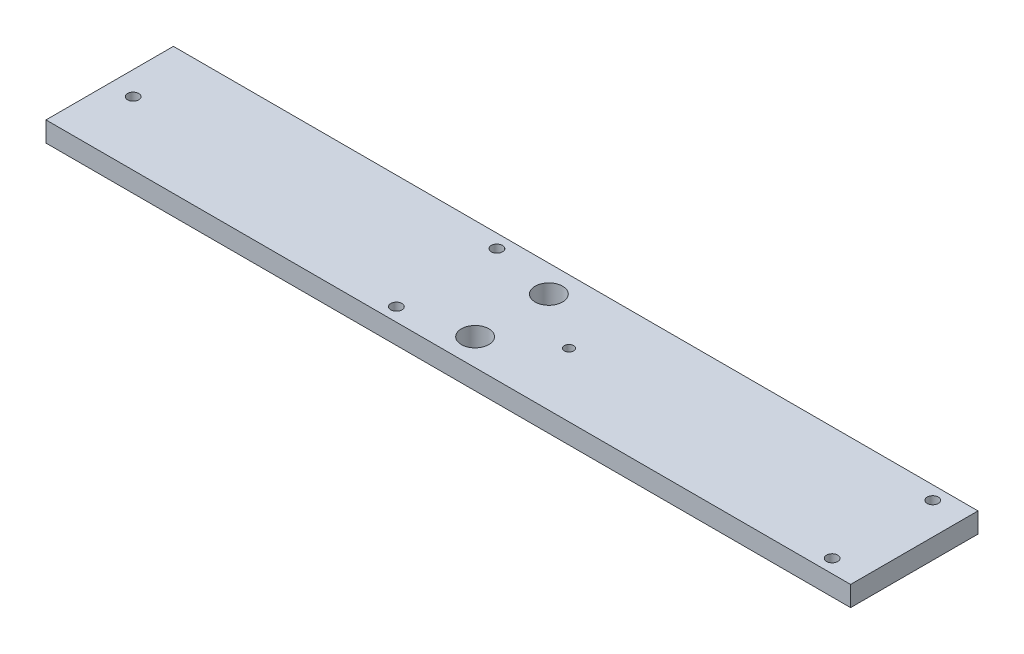
ISO-10303-21;
HEADER;
FILE_DESCRIPTION(('STEP AP214'),'2;1');
FILE_NAME('part.step','',(''),(''),'','','');
FILE_SCHEMA(('AUTOMOTIVE_DESIGN { 1 0 10303 214 1 1 1 1 }'));
ENDSEC;
DATA;
#1=APPLICATION_CONTEXT('core data for automotive mechanical design processes');
#2=APPLICATION_PROTOCOL_DEFINITION('international standard','automotive_design',2000,#1);
#3=PRODUCT_CONTEXT('',#1,'mechanical');
#4=PRODUCT('Part','Part','',(#3));
#5=PRODUCT_RELATED_PRODUCT_CATEGORY('part','',(#4));
#6=PRODUCT_DEFINITION_FORMATION('','',#4);
#7=PRODUCT_DEFINITION_CONTEXT('part definition',#1,'design');
#8=PRODUCT_DEFINITION('design','',#6,#7);
#9=PRODUCT_DEFINITION_SHAPE('','',#8);
#10=(LENGTH_UNIT() NAMED_UNIT(*) SI_UNIT(.MILLI.,.METRE.));
#11=(NAMED_UNIT(*) PLANE_ANGLE_UNIT() SI_UNIT($,.RADIAN.));
#12=(NAMED_UNIT(*) SI_UNIT($,.STERADIAN.) SOLID_ANGLE_UNIT());
#13=UNCERTAINTY_MEASURE_WITH_UNIT(LENGTH_MEASURE(1.E-05),#10,'distance_accuracy_value','');
#14=(GEOMETRIC_REPRESENTATION_CONTEXT(3) GLOBAL_UNCERTAINTY_ASSIGNED_CONTEXT((#13)) GLOBAL_UNIT_ASSIGNED_CONTEXT((#10,
#11,#12)) REPRESENTATION_CONTEXT('',''));
#15=CARTESIAN_POINT('',(0.,0.,0.));
#16=DIRECTION('',(0.,0.,1.));
#17=DIRECTION('',(1.,0.,0.));
#18=AXIS2_PLACEMENT_3D('',#15,#16,#17);
#19=CARTESIAN_POINT('',(0.,3.,0.));
#20=DIRECTION('',(1.,0.,0.));
#21=DIRECTION('',(0.,0.,-1.));
#22=AXIS2_PLACEMENT_3D('',#19,#20,#21);
#23=PLANE('',#22);
#24=DIRECTION('',(0.,0.,1.));
#25=VECTOR('',#24,1.);
#26=CARTESIAN_POINT('',(0.,0.,0.));
#27=LINE('',#26,#25);
#28=CARTESIAN_POINT('',(0.,0.,-19.));
#29=VERTEX_POINT('',#28);
#30=CARTESIAN_POINT('',(0.,0.,0.));
#31=VERTEX_POINT('',#30);
#32=EDGE_CURVE('E102',#29,#31,#27,.T.);
#33=ORIENTED_EDGE('',*,*,#32,.T.);
#34=DIRECTION('',(0.,-1.,0.));
#35=VECTOR('',#34,1.);
#36=CARTESIAN_POINT('',(0.,3.,0.));
#37=LINE('',#36,#35);
#38=CARTESIAN_POINT('',(0.,3.,0.));
#39=VERTEX_POINT('',#38);
#40=EDGE_CURVE('E11',#39,#31,#37,.T.);
#41=ORIENTED_EDGE('',*,*,#40,.F.);
#42=DIRECTION('',(0.,0.,1.));
#43=VECTOR('',#42,1.);
#44=CARTESIAN_POINT('',(0.,3.,0.));
#45=LINE('',#44,#43);
#46=CARTESIAN_POINT('',(0.,3.,-19.));
#47=VERTEX_POINT('',#46);
#48=EDGE_CURVE('E90',#47,#39,#45,.T.);
#49=ORIENTED_EDGE('',*,*,#48,.F.);
#50=DIRECTION('',(0.,-1.,0.));
#51=VECTOR('',#50,1.);
#52=CARTESIAN_POINT('',(0.,3.,-19.));
#53=LINE('',#52,#51);
#54=EDGE_CURVE('E98',#47,#29,#53,.T.);
#55=ORIENTED_EDGE('',*,*,#54,.T.);
#56=EDGE_LOOP('',(#33,#41,#49,#55));
#57=FACE_BOUND('',#56,.T.);
#58=ADVANCED_FACE('F39',(#57),#23,.F.);
#59=CARTESIAN_POINT('',(0.,3.,0.));
#60=DIRECTION('',(0.,0.,-1.));
#61=DIRECTION('',(-1.,0.,0.));
#62=AXIS2_PLACEMENT_3D('',#59,#60,#61);
#63=PLANE('',#62);
#64=DIRECTION('',(1.,0.,0.));
#65=VECTOR('',#64,1.);
#66=CARTESIAN_POINT('',(0.,0.,0.));
#67=LINE('',#66,#65);
#68=CARTESIAN_POINT('',(120.,0.,0.));
#69=VERTEX_POINT('',#68);
#70=EDGE_CURVE('E94',#31,#69,#67,.T.);
#71=ORIENTED_EDGE('',*,*,#70,.T.);
#72=DIRECTION('',(0.,-1.,0.));
#73=VECTOR('',#72,1.);
#74=CARTESIAN_POINT('',(120.,3.,0.));
#75=LINE('',#74,#73);
#76=CARTESIAN_POINT('',(120.,3.,0.));
#77=VERTEX_POINT('',#76);
#78=EDGE_CURVE('E47',#77,#69,#75,.T.);
#79=ORIENTED_EDGE('',*,*,#78,.F.);
#80=DIRECTION('',(1.,0.,0.));
#81=VECTOR('',#80,1.);
#82=CARTESIAN_POINT('',(0.,3.,0.));
#83=LINE('',#82,#81);
#84=EDGE_CURVE('E85',#39,#77,#83,.T.);
#85=ORIENTED_EDGE('',*,*,#84,.F.);
#86=ORIENTED_EDGE('',*,*,#40,.T.);
#87=EDGE_LOOP('',(#71,#79,#85,#86));
#88=FACE_BOUND('',#87,.T.);
#89=ADVANCED_FACE('F93',(#88),#63,.F.);
#90=CARTESIAN_POINT('',(120.,3.,0.));
#91=DIRECTION('',(-1.,0.,0.));
#92=DIRECTION('',(0.,0.,1.));
#93=AXIS2_PLACEMENT_3D('',#90,#91,#92);
#94=PLANE('',#93);
#95=DIRECTION('',(0.,0.,-1.));
#96=VECTOR('',#95,1.);
#97=CARTESIAN_POINT('',(120.,0.,0.));
#98=LINE('',#97,#96);
#99=CARTESIAN_POINT('',(120.,0.,-19.));
#100=VERTEX_POINT('',#99);
#101=EDGE_CURVE('E72',#69,#100,#98,.T.);
#102=ORIENTED_EDGE('',*,*,#101,.T.);
#103=DIRECTION('',(0.,-1.,0.));
#104=VECTOR('',#103,1.);
#105=CARTESIAN_POINT('',(120.,3.,-19.));
#106=LINE('',#105,#104);
#107=CARTESIAN_POINT('',(120.,3.,-19.));
#108=VERTEX_POINT('',#107);
#109=EDGE_CURVE('E95',#108,#100,#106,.T.);
#110=ORIENTED_EDGE('',*,*,#109,.F.);
#111=DIRECTION('',(0.,0.,-1.));
#112=VECTOR('',#111,1.);
#113=CARTESIAN_POINT('',(120.,3.,0.));
#114=LINE('',#113,#112);
#115=EDGE_CURVE('E88',#77,#108,#114,.T.);
#116=ORIENTED_EDGE('',*,*,#115,.F.);
#117=ORIENTED_EDGE('',*,*,#78,.T.);
#118=EDGE_LOOP('',(#102,#110,#116,#117));
#119=FACE_BOUND('',#118,.T.);
#120=ADVANCED_FACE('F96',(#119),#94,.F.);
#121=CARTESIAN_POINT('',(0.,3.,-19.));
#122=DIRECTION('',(0.,0.,1.));
#123=DIRECTION('',(1.,0.,0.));
#124=AXIS2_PLACEMENT_3D('',#121,#122,#123);
#125=PLANE('',#124);
#126=DIRECTION('',(-1.,0.,0.));
#127=VECTOR('',#126,1.);
#128=CARTESIAN_POINT('',(0.,0.,-19.));
#129=LINE('',#128,#127);
#130=EDGE_CURVE('E78',#100,#29,#129,.T.);
#131=ORIENTED_EDGE('',*,*,#130,.T.);
#132=ORIENTED_EDGE('',*,*,#54,.F.);
#133=DIRECTION('',(-1.,0.,0.));
#134=VECTOR('',#133,1.);
#135=CARTESIAN_POINT('',(0.,3.,-19.));
#136=LINE('',#135,#134);
#137=EDGE_CURVE('E55',#108,#47,#136,.T.);
#138=ORIENTED_EDGE('',*,*,#137,.F.);
#139=ORIENTED_EDGE('',*,*,#109,.T.);
#140=EDGE_LOOP('',(#131,#132,#138,#139));
#141=FACE_BOUND('',#140,.T.);
#142=ADVANCED_FACE('F110',(#141),#125,.F.);
#143=CARTESIAN_POINT('',(0.,3.,0.));
#144=DIRECTION('',(0.,-1.,0.));
#145=DIRECTION('',(0.,0.,-1.));
#146=AXIS2_PLACEMENT_3D('',#143,#144,#145);
#147=PLANE('',#146);
#148=CARTESIAN_POINT('',(3.5,3.,-9.5));
#149=DIRECTION('',(0.,1.,0.));
#150=DIRECTION('',(0.,0.,1.));
#151=AXIS2_PLACEMENT_3D('',#148,#149,#150);
#152=CIRCLE('',#151,0.834999999999999);
#153=CARTESIAN_POINT('',(3.5,3.,-8.665));
#154=VERTEX_POINT('',#153);
#155=EDGE_CURVE('E141',#154,#154,#152,.T.);
#156=ORIENTED_EDGE('',*,*,#155,.F.);
#157=EDGE_LOOP('',(#156));
#158=FACE_BOUND('',#157,.T.);
#159=CARTESIAN_POINT('',(115.25,3.,-2.));
#160=DIRECTION('',(0.,1.,0.));
#161=DIRECTION('',(0.,0.,1.));
#162=AXIS2_PLACEMENT_3D('',#159,#160,#161);
#163=CIRCLE('',#162,0.835000000000005);
#164=CARTESIAN_POINT('',(115.25,3.,-1.165));
#165=VERTEX_POINT('',#164);
#166=EDGE_CURVE('E120',#165,#165,#163,.T.);
#167=ORIENTED_EDGE('',*,*,#166,.F.);
#168=EDGE_LOOP('',(#167));
#169=FACE_BOUND('',#168,.T.);
#170=CARTESIAN_POINT('',(60.,3.,-15.));
#171=DIRECTION('',(0.,1.,0.));
#172=DIRECTION('',(0.,0.,1.));
#173=AXIS2_PLACEMENT_3D('',#170,#171,#172);
#174=CIRCLE('',#173,2.04999999999999);
#175=CARTESIAN_POINT('',(60.,3.,-12.95));
#176=VERTEX_POINT('',#175);
#177=EDGE_CURVE('E145',#176,#176,#174,.T.);
#178=ORIENTED_EDGE('',*,*,#177,.F.);
#179=EDGE_LOOP('',(#178));
#180=FACE_BOUND('',#179,.T.);
#181=CARTESIAN_POINT('',(60.,3.,-4.));
#182=DIRECTION('',(0.,1.,0.));
#183=DIRECTION('',(0.,0.,1.));
#184=AXIS2_PLACEMENT_3D('',#181,#182,#183);
#185=CIRCLE('',#184,2.04999999999999);
#186=CARTESIAN_POINT('',(60.,3.,-1.95000000000001));
#187=VERTEX_POINT('',#186);
#188=EDGE_CURVE('E146',#187,#187,#185,.T.);
#189=ORIENTED_EDGE('',*,*,#188,.F.);
#190=EDGE_LOOP('',(#189));
#191=FACE_BOUND('',#190,.T.);
#192=CARTESIAN_POINT('',(115.25,3.,-17.));
#193=DIRECTION('',(0.,1.,0.));
#194=DIRECTION('',(0.,0.,1.));
#195=AXIS2_PLACEMENT_3D('',#192,#193,#194);
#196=CIRCLE('',#195,0.835000000000005);
#197=CARTESIAN_POINT('',(115.25,3.,-16.165));
#198=VERTEX_POINT('',#197);
#199=EDGE_CURVE('E119',#198,#198,#196,.T.);
#200=ORIENTED_EDGE('',*,*,#199,.F.);
#201=EDGE_LOOP('',(#200));
#202=FACE_BOUND('',#201,.T.);
#203=CARTESIAN_POINT('',(68.5,3.,-9.5));
#204=DIRECTION('',(0.,1.,0.));
#205=DIRECTION('',(0.,0.,1.));
#206=AXIS2_PLACEMENT_3D('',#203,#204,#205);
#207=CIRCLE('',#206,0.694256010186921);
#208=CARTESIAN_POINT('',(68.5,3.,-8.80574398981308));
#209=VERTEX_POINT('',#208);
#210=EDGE_CURVE('E126',#209,#209,#207,.T.);
#211=ORIENTED_EDGE('',*,*,#210,.F.);
#212=EDGE_LOOP('',(#211));
#213=FACE_BOUND('',#212,.T.);
#214=CARTESIAN_POINT('',(50.25,3.,-2.));
#215=DIRECTION('',(0.,1.,0.));
#216=DIRECTION('',(0.,0.,1.));
#217=AXIS2_PLACEMENT_3D('',#214,#215,#216);
#218=CIRCLE('',#217,0.835000000000005);
#219=CARTESIAN_POINT('',(50.25,3.,-1.16499999999999));
#220=VERTEX_POINT('',#219);
#221=EDGE_CURVE('E132',#220,#220,#218,.T.);
#222=ORIENTED_EDGE('',*,*,#221,.F.);
#223=EDGE_LOOP('',(#222));
#224=FACE_BOUND('',#223,.T.);
#225=CARTESIAN_POINT('',(50.25,3.,-17.));
#226=DIRECTION('',(0.,1.,0.));
#227=DIRECTION('',(0.,0.,1.));
#228=AXIS2_PLACEMENT_3D('',#225,#226,#227);
#229=CIRCLE('',#228,0.835000000000005);
#230=CARTESIAN_POINT('',(50.25,3.,-16.165));
#231=VERTEX_POINT('',#230);
#232=EDGE_CURVE('E138',#231,#231,#229,.T.);
#233=ORIENTED_EDGE('',*,*,#232,.F.);
#234=EDGE_LOOP('',(#233));
#235=FACE_BOUND('',#234,.T.);
#236=ORIENTED_EDGE('',*,*,#48,.T.);
#237=ORIENTED_EDGE('',*,*,#84,.T.);
#238=ORIENTED_EDGE('',*,*,#115,.T.);
#239=ORIENTED_EDGE('',*,*,#137,.T.);
#240=EDGE_LOOP('',(#236,#237,#238,#239));
#241=FACE_BOUND('',#240,.T.);
#242=ADVANCED_FACE('F86',(#158,#169,#180,#191,#202,#213,#224,#235,#241),#147,.F.);
#243=CARTESIAN_POINT('',(0.,0.,0.));
#244=DIRECTION('',(0.,-1.,0.));
#245=DIRECTION('',(0.,0.,-1.));
#246=AXIS2_PLACEMENT_3D('',#243,#244,#245);
#247=PLANE('',#246);
#248=CARTESIAN_POINT('',(3.5,0.,-9.5));
#249=DIRECTION('',(0.,1.,0.));
#250=DIRECTION('',(0.,0.,1.));
#251=AXIS2_PLACEMENT_3D('',#248,#249,#250);
#252=CIRCLE('',#251,0.834999999999999);
#253=CARTESIAN_POINT('',(3.5,0.,-8.665));
#254=VERTEX_POINT('',#253);
#255=EDGE_CURVE('E105',#254,#254,#252,.T.);
#256=ORIENTED_EDGE('',*,*,#255,.T.);
#257=EDGE_LOOP('',(#256));
#258=FACE_BOUND('',#257,.T.);
#259=CARTESIAN_POINT('',(115.25,0.,-2.));
#260=DIRECTION('',(0.,1.,0.));
#261=DIRECTION('',(0.,0.,1.));
#262=AXIS2_PLACEMENT_3D('',#259,#260,#261);
#263=CIRCLE('',#262,0.835000000000005);
#264=CARTESIAN_POINT('',(115.25,0.,-1.165));
#265=VERTEX_POINT('',#264);
#266=EDGE_CURVE('E149',#265,#265,#263,.T.);
#267=ORIENTED_EDGE('',*,*,#266,.T.);
#268=EDGE_LOOP('',(#267));
#269=FACE_BOUND('',#268,.T.);
#270=CARTESIAN_POINT('',(60.,0.,-15.));
#271=DIRECTION('',(0.,1.,0.));
#272=DIRECTION('',(0.,0.,1.));
#273=AXIS2_PLACEMENT_3D('',#270,#271,#272);
#274=CIRCLE('',#273,2.04999999999999);
#275=CARTESIAN_POINT('',(60.,0.,-12.95));
#276=VERTEX_POINT('',#275);
#277=EDGE_CURVE('E142',#276,#276,#274,.T.);
#278=ORIENTED_EDGE('',*,*,#277,.T.);
#279=EDGE_LOOP('',(#278));
#280=FACE_BOUND('',#279,.T.);
#281=CARTESIAN_POINT('',(60.,0.,-4.));
#282=DIRECTION('',(0.,1.,0.));
#283=DIRECTION('',(0.,0.,1.));
#284=AXIS2_PLACEMENT_3D('',#281,#282,#283);
#285=CIRCLE('',#284,2.04999999999999);
#286=CARTESIAN_POINT('',(60.,0.,-1.95000000000001));
#287=VERTEX_POINT('',#286);
#288=EDGE_CURVE('E154',#287,#287,#285,.T.);
#289=ORIENTED_EDGE('',*,*,#288,.T.);
#290=EDGE_LOOP('',(#289));
#291=FACE_BOUND('',#290,.T.);
#292=CARTESIAN_POINT('',(115.25,0.,-17.));
#293=DIRECTION('',(0.,1.,0.));
#294=DIRECTION('',(0.,0.,1.));
#295=AXIS2_PLACEMENT_3D('',#292,#293,#294);
#296=CIRCLE('',#295,0.835000000000005);
#297=CARTESIAN_POINT('',(115.25,0.,-16.165));
#298=VERTEX_POINT('',#297);
#299=EDGE_CURVE('E116',#298,#298,#296,.T.);
#300=ORIENTED_EDGE('',*,*,#299,.T.);
#301=EDGE_LOOP('',(#300));
#302=FACE_BOUND('',#301,.T.);
#303=CARTESIAN_POINT('',(68.5,0.,-9.5));
#304=DIRECTION('',(0.,1.,0.));
#305=DIRECTION('',(0.,0.,1.));
#306=AXIS2_PLACEMENT_3D('',#303,#304,#305);
#307=CIRCLE('',#306,0.694256010186921);
#308=CARTESIAN_POINT('',(68.5,0.,-8.80574398981308));
#309=VERTEX_POINT('',#308);
#310=EDGE_CURVE('E123',#309,#309,#307,.T.);
#311=ORIENTED_EDGE('',*,*,#310,.T.);
#312=EDGE_LOOP('',(#311));
#313=FACE_BOUND('',#312,.T.);
#314=CARTESIAN_POINT('',(50.25,0.,-2.));
#315=DIRECTION('',(0.,1.,0.));
#316=DIRECTION('',(0.,0.,1.));
#317=AXIS2_PLACEMENT_3D('',#314,#315,#316);
#318=CIRCLE('',#317,0.835000000000005);
#319=CARTESIAN_POINT('',(50.25,0.,-1.16499999999999));
#320=VERTEX_POINT('',#319);
#321=EDGE_CURVE('E129',#320,#320,#318,.T.);
#322=ORIENTED_EDGE('',*,*,#321,.T.);
#323=EDGE_LOOP('',(#322));
#324=FACE_BOUND('',#323,.T.);
#325=CARTESIAN_POINT('',(50.25,0.,-17.));
#326=DIRECTION('',(0.,1.,0.));
#327=DIRECTION('',(0.,0.,1.));
#328=AXIS2_PLACEMENT_3D('',#325,#326,#327);
#329=CIRCLE('',#328,0.835000000000005);
#330=CARTESIAN_POINT('',(50.25,0.,-16.165));
#331=VERTEX_POINT('',#330);
#332=EDGE_CURVE('E135',#331,#331,#329,.T.);
#333=ORIENTED_EDGE('',*,*,#332,.T.);
#334=EDGE_LOOP('',(#333));
#335=FACE_BOUND('',#334,.T.);
#336=ORIENTED_EDGE('',*,*,#32,.F.);
#337=ORIENTED_EDGE('',*,*,#130,.F.);
#338=ORIENTED_EDGE('',*,*,#101,.F.);
#339=ORIENTED_EDGE('',*,*,#70,.F.);
#340=EDGE_LOOP('',(#336,#337,#338,#339));
#341=FACE_BOUND('',#340,.T.);
#342=ADVANCED_FACE('F113',(#258,#269,#280,#291,#302,#313,#324,#335,#341),#247,.T.);
#343=CARTESIAN_POINT('',(50.25,0.,-17.));
#344=DIRECTION('',(0.,1.,0.));
#345=DIRECTION('',(0.,0.,1.));
#346=AXIS2_PLACEMENT_3D('',#343,#344,#345);
#347=CYLINDRICAL_SURFACE('',#346,0.835000000000005);
#348=ORIENTED_EDGE('',*,*,#332,.F.);
#349=EDGE_LOOP('',(#348));
#350=FACE_BOUND('',#349,.T.);
#351=ORIENTED_EDGE('',*,*,#232,.T.);
#352=EDGE_LOOP('',(#351));
#353=FACE_BOUND('',#352,.T.);
#354=ADVANCED_FACE('F190',(#350,#353),#347,.F.);
#355=CARTESIAN_POINT('',(50.25,0.,-2.));
#356=DIRECTION('',(0.,1.,0.));
#357=DIRECTION('',(0.,0.,1.));
#358=AXIS2_PLACEMENT_3D('',#355,#356,#357);
#359=CYLINDRICAL_SURFACE('',#358,0.835000000000005);
#360=ORIENTED_EDGE('',*,*,#321,.F.);
#361=EDGE_LOOP('',(#360));
#362=FACE_BOUND('',#361,.T.);
#363=ORIENTED_EDGE('',*,*,#221,.T.);
#364=EDGE_LOOP('',(#363));
#365=FACE_BOUND('',#364,.T.);
#366=ADVANCED_FACE('F192',(#362,#365),#359,.F.);
#367=CARTESIAN_POINT('',(68.5,0.,-9.5));
#368=DIRECTION('',(0.,1.,0.));
#369=DIRECTION('',(0.,0.,1.));
#370=AXIS2_PLACEMENT_3D('',#367,#368,#369);
#371=CYLINDRICAL_SURFACE('',#370,0.694256010186921);
#372=ORIENTED_EDGE('',*,*,#310,.F.);
#373=EDGE_LOOP('',(#372));
#374=FACE_BOUND('',#373,.T.);
#375=ORIENTED_EDGE('',*,*,#210,.T.);
#376=EDGE_LOOP('',(#375));
#377=FACE_BOUND('',#376,.T.);
#378=ADVANCED_FACE('F199',(#374,#377),#371,.F.);
#379=CARTESIAN_POINT('',(115.25,0.,-17.));
#380=DIRECTION('',(0.,1.,0.));
#381=DIRECTION('',(0.,0.,1.));
#382=AXIS2_PLACEMENT_3D('',#379,#380,#381);
#383=CYLINDRICAL_SURFACE('',#382,0.835000000000005);
#384=ORIENTED_EDGE('',*,*,#299,.F.);
#385=EDGE_LOOP('',(#384));
#386=FACE_BOUND('',#385,.T.);
#387=ORIENTED_EDGE('',*,*,#199,.T.);
#388=EDGE_LOOP('',(#387));
#389=FACE_BOUND('',#388,.T.);
#390=ADVANCED_FACE('F216',(#386,#389),#383,.F.);
#391=CARTESIAN_POINT('',(60.,0.,-4.));
#392=DIRECTION('',(0.,1.,0.));
#393=DIRECTION('',(0.,0.,1.));
#394=AXIS2_PLACEMENT_3D('',#391,#392,#393);
#395=CYLINDRICAL_SURFACE('',#394,2.04999999999999);
#396=ORIENTED_EDGE('',*,*,#288,.F.);
#397=EDGE_LOOP('',(#396));
#398=FACE_BOUND('',#397,.T.);
#399=ORIENTED_EDGE('',*,*,#188,.T.);
#400=EDGE_LOOP('',(#399));
#401=FACE_BOUND('',#400,.T.);
#402=ADVANCED_FACE('F219',(#398,#401),#395,.F.);
#403=CARTESIAN_POINT('',(60.,0.,-15.));
#404=DIRECTION('',(0.,1.,0.));
#405=DIRECTION('',(0.,0.,1.));
#406=AXIS2_PLACEMENT_3D('',#403,#404,#405);
#407=CYLINDRICAL_SURFACE('',#406,2.04999999999999);
#408=ORIENTED_EDGE('',*,*,#277,.F.);
#409=EDGE_LOOP('',(#408));
#410=FACE_BOUND('',#409,.T.);
#411=ORIENTED_EDGE('',*,*,#177,.T.);
#412=EDGE_LOOP('',(#411));
#413=FACE_BOUND('',#412,.T.);
#414=ADVANCED_FACE('F246',(#410,#413),#407,.F.);
#415=CARTESIAN_POINT('',(115.25,0.,-2.));
#416=DIRECTION('',(0.,1.,0.));
#417=DIRECTION('',(0.,0.,1.));
#418=AXIS2_PLACEMENT_3D('',#415,#416,#417);
#419=CYLINDRICAL_SURFACE('',#418,0.835000000000005);
#420=ORIENTED_EDGE('',*,*,#266,.F.);
#421=EDGE_LOOP('',(#420));
#422=FACE_BOUND('',#421,.T.);
#423=ORIENTED_EDGE('',*,*,#166,.T.);
#424=EDGE_LOOP('',(#423));
#425=FACE_BOUND('',#424,.T.);
#426=ADVANCED_FACE('F169',(#422,#425),#419,.F.);
#427=CARTESIAN_POINT('',(3.5,0.,-9.5));
#428=DIRECTION('',(0.,1.,0.));
#429=DIRECTION('',(0.,0.,1.));
#430=AXIS2_PLACEMENT_3D('',#427,#428,#429);
#431=CYLINDRICAL_SURFACE('',#430,0.834999999999999);
#432=ORIENTED_EDGE('',*,*,#255,.F.);
#433=EDGE_LOOP('',(#432));
#434=FACE_BOUND('',#433,.T.);
#435=ORIENTED_EDGE('',*,*,#155,.T.);
#436=EDGE_LOOP('',(#435));
#437=FACE_BOUND('',#436,.T.);
#438=ADVANCED_FACE('F166',(#434,#437),#431,.F.);
#439=CLOSED_SHELL('',(#58,#89,#120,#142,#242,#342,#354,#366,#378,#390,#402,#414,#426,#438));
#440=MANIFOLD_SOLID_BREP('B2',#439);
#441=ADVANCED_BREP_SHAPE_REPRESENTATION('',(#18,#440),#14);
#442=SHAPE_DEFINITION_REPRESENTATION(#9,#441);
ENDSEC;
END-ISO-10303-21;
